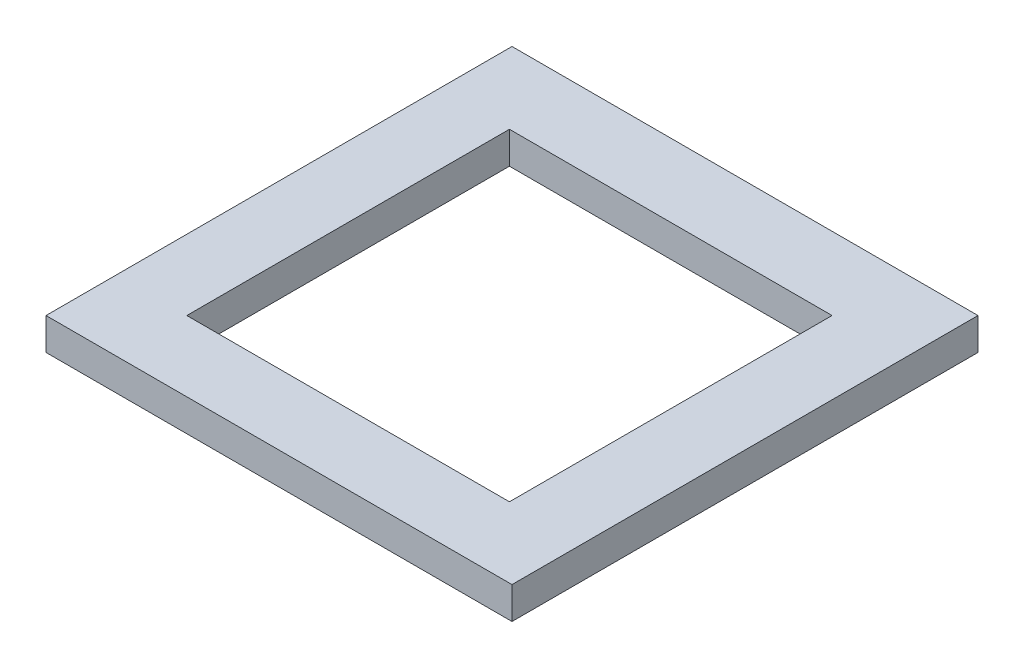
ISO-10303-21;
HEADER;
FILE_DESCRIPTION(('STEP AP214'),'2;1');
FILE_NAME('part.step','',(''),(''),'','','');
FILE_SCHEMA(('AUTOMOTIVE_DESIGN { 1 0 10303 214 1 1 1 1 }'));
ENDSEC;
DATA;
#1=APPLICATION_CONTEXT('core data for automotive mechanical design processes');
#2=APPLICATION_PROTOCOL_DEFINITION('international standard','automotive_design',2000,#1);
#3=PRODUCT_CONTEXT('',#1,'mechanical');
#4=PRODUCT('Part','Part','',(#3));
#5=PRODUCT_RELATED_PRODUCT_CATEGORY('part','',(#4));
#6=PRODUCT_DEFINITION_FORMATION('','',#4);
#7=PRODUCT_DEFINITION_CONTEXT('part definition',#1,'design');
#8=PRODUCT_DEFINITION('design','',#6,#7);
#9=PRODUCT_DEFINITION_SHAPE('','',#8);
#10=(LENGTH_UNIT() NAMED_UNIT(*) SI_UNIT(.MILLI.,.METRE.));
#11=(NAMED_UNIT(*) PLANE_ANGLE_UNIT() SI_UNIT($,.RADIAN.));
#12=(NAMED_UNIT(*) SI_UNIT($,.STERADIAN.) SOLID_ANGLE_UNIT());
#13=UNCERTAINTY_MEASURE_WITH_UNIT(LENGTH_MEASURE(1.E-05),#10,'distance_accuracy_value','');
#14=(GEOMETRIC_REPRESENTATION_CONTEXT(3) GLOBAL_UNCERTAINTY_ASSIGNED_CONTEXT((#13)) GLOBAL_UNIT_ASSIGNED_CONTEXT((#10,
#11,#12)) REPRESENTATION_CONTEXT('',''));
#15=CARTESIAN_POINT('',(0.,0.,0.));
#16=DIRECTION('',(0.,0.,1.));
#17=DIRECTION('',(1.,0.,0.));
#18=AXIS2_PLACEMENT_3D('',#15,#16,#17);
#19=CARTESIAN_POINT('',(0.,3.175,0.));
#20=DIRECTION('',(0.,-1.,0.));
#21=DIRECTION('',(0.,0.,-1.));
#22=AXIS2_PLACEMENT_3D('',#19,#20,#21);
#23=PLANE('',#22);
#24=DIRECTION('',(0.,0.,-1.));
#25=VECTOR('',#24,1.);
#26=CARTESIAN_POINT('',(296.475530674392,3.175,-285.287805934991));
#27=LINE('',#26,#25);
#28=CARTESIAN_POINT('',(296.475530674392,3.175,-285.287805934991));
#29=VERTEX_POINT('',#28);
#30=CARTESIAN_POINT('',(296.475530674392,3.175,-331.515805934991));
#31=VERTEX_POINT('',#30);
#32=EDGE_CURVE('E134',#29,#31,#27,.T.);
#33=ORIENTED_EDGE('',*,*,#32,.T.);
#34=DIRECTION('',(-1.,0.,0.));
#35=VECTOR('',#34,1.);
#36=CARTESIAN_POINT('',(250.247530674392,3.175,-331.515805934991));
#37=LINE('',#36,#35);
#38=CARTESIAN_POINT('',(250.247530674392,3.175,-331.515805934991));
#39=VERTEX_POINT('',#38);
#40=EDGE_CURVE('E137',#31,#39,#37,.T.);
#41=ORIENTED_EDGE('',*,*,#40,.T.);
#42=DIRECTION('',(0.,0.,1.));
#43=VECTOR('',#42,1.);
#44=CARTESIAN_POINT('',(250.247530674392,3.175,-285.287805934991));
#45=LINE('',#44,#43);
#46=CARTESIAN_POINT('',(250.247530674392,3.175,-285.287805934991));
#47=VERTEX_POINT('',#46);
#48=EDGE_CURVE('E140',#39,#47,#45,.T.);
#49=ORIENTED_EDGE('',*,*,#48,.T.);
#50=DIRECTION('',(1.,0.,0.));
#51=VECTOR('',#50,1.);
#52=CARTESIAN_POINT('',(250.247530674392,3.175,-285.287805934991));
#53=LINE('',#52,#51);
#54=EDGE_CURVE('E142',#47,#29,#53,.T.);
#55=ORIENTED_EDGE('',*,*,#54,.T.);
#56=EDGE_LOOP('',(#33,#41,#49,#55));
#57=FACE_BOUND('',#56,.T.);
#58=DIRECTION('',(0.,0.,-1.));
#59=VECTOR('',#58,1.);
#60=CARTESIAN_POINT('',(289.236530674392,3.175,-292.272805934991));
#61=LINE('',#60,#59);
#62=CARTESIAN_POINT('',(289.236530674392,3.175,-292.272805934991));
#63=VERTEX_POINT('',#62);
#64=CARTESIAN_POINT('',(289.236530674392,3.175,-324.276805934991));
#65=VERTEX_POINT('',#64);
#66=EDGE_CURVE('E98',#63,#65,#61,.T.);
#67=ORIENTED_EDGE('',*,*,#66,.F.);
#68=DIRECTION('',(1.,0.,0.));
#69=VECTOR('',#68,1.);
#70=CARTESIAN_POINT('',(257.232530674392,3.175,-292.272805934991));
#71=LINE('',#70,#69);
#72=CARTESIAN_POINT('',(257.232530674392,3.175,-292.272805934991));
#73=VERTEX_POINT('',#72);
#74=EDGE_CURVE('E120',#73,#63,#71,.T.);
#75=ORIENTED_EDGE('',*,*,#74,.F.);
#76=DIRECTION('',(0.,0.,1.));
#77=VECTOR('',#76,1.);
#78=CARTESIAN_POINT('',(257.232530674392,3.175,-292.272805934991));
#79=LINE('',#78,#77);
#80=CARTESIAN_POINT('',(257.232530674392,3.175,-324.276805934991));
#81=VERTEX_POINT('',#80);
#82=EDGE_CURVE('E118',#81,#73,#79,.T.);
#83=ORIENTED_EDGE('',*,*,#82,.F.);
#84=DIRECTION('',(-1.,0.,0.));
#85=VECTOR('',#84,1.);
#86=CARTESIAN_POINT('',(257.232530674392,3.175,-324.276805934991));
#87=LINE('',#86,#85);
#88=EDGE_CURVE('E106',#65,#81,#87,.T.);
#89=ORIENTED_EDGE('',*,*,#88,.F.);
#90=EDGE_LOOP('',(#67,#75,#83,#89));
#91=FACE_BOUND('',#90,.T.);
#92=ADVANCED_FACE('F33',(#57,#91),#23,.F.);
#93=CARTESIAN_POINT('',(0.,0.,0.));
#94=DIRECTION('',(0.,-1.,0.));
#95=DIRECTION('',(0.,0.,-1.));
#96=AXIS2_PLACEMENT_3D('',#93,#94,#95);
#97=PLANE('',#96);
#98=DIRECTION('',(0.,0.,-1.));
#99=VECTOR('',#98,1.);
#100=CARTESIAN_POINT('',(296.475530674392,0.,-285.287805934991));
#101=LINE('',#100,#99);
#102=CARTESIAN_POINT('',(296.475530674392,0.,-285.287805934991));
#103=VERTEX_POINT('',#102);
#104=CARTESIAN_POINT('',(296.475530674392,0.,-331.515805934991));
#105=VERTEX_POINT('',#104);
#106=EDGE_CURVE('E114',#103,#105,#101,.T.);
#107=ORIENTED_EDGE('',*,*,#106,.F.);
#108=DIRECTION('',(1.,0.,0.));
#109=VECTOR('',#108,1.);
#110=CARTESIAN_POINT('',(250.247530674392,0.,-285.287805934991));
#111=LINE('',#110,#109);
#112=CARTESIAN_POINT('',(250.247530674392,0.,-285.287805934991));
#113=VERTEX_POINT('',#112);
#114=EDGE_CURVE('E138',#113,#103,#111,.T.);
#115=ORIENTED_EDGE('',*,*,#114,.F.);
#116=DIRECTION('',(0.,0.,1.));
#117=VECTOR('',#116,1.);
#118=CARTESIAN_POINT('',(250.247530674392,0.,-285.287805934991));
#119=LINE('',#118,#117);
#120=CARTESIAN_POINT('',(250.247530674392,0.,-331.515805934991));
#121=VERTEX_POINT('',#120);
#122=EDGE_CURVE('E149',#121,#113,#119,.T.);
#123=ORIENTED_EDGE('',*,*,#122,.F.);
#124=DIRECTION('',(-1.,0.,0.));
#125=VECTOR('',#124,1.);
#126=CARTESIAN_POINT('',(250.247530674392,0.,-331.515805934991));
#127=LINE('',#126,#125);
#128=EDGE_CURVE('E147',#105,#121,#127,.T.);
#129=ORIENTED_EDGE('',*,*,#128,.F.);
#130=EDGE_LOOP('',(#107,#115,#123,#129));
#131=FACE_BOUND('',#130,.T.);
#132=DIRECTION('',(1.,0.,0.));
#133=VECTOR('',#132,1.);
#134=CARTESIAN_POINT('',(257.232530674392,0.,-292.272805934991));
#135=LINE('',#134,#133);
#136=CARTESIAN_POINT('',(257.232530674392,0.,-292.272805934991));
#137=VERTEX_POINT('',#136);
#138=CARTESIAN_POINT('',(289.236530674392,0.,-292.272805934991));
#139=VERTEX_POINT('',#138);
#140=EDGE_CURVE('E107',#137,#139,#135,.T.);
#141=ORIENTED_EDGE('',*,*,#140,.T.);
#142=DIRECTION('',(0.,0.,-1.));
#143=VECTOR('',#142,1.);
#144=CARTESIAN_POINT('',(289.236530674392,0.,-292.272805934991));
#145=LINE('',#144,#143);
#146=CARTESIAN_POINT('',(289.236530674392,0.,-324.276805934991));
#147=VERTEX_POINT('',#146);
#148=EDGE_CURVE('E56',#139,#147,#145,.T.);
#149=ORIENTED_EDGE('',*,*,#148,.T.);
#150=DIRECTION('',(-1.,0.,0.));
#151=VECTOR('',#150,1.);
#152=CARTESIAN_POINT('',(257.232530674392,0.,-324.276805934991));
#153=LINE('',#152,#151);
#154=CARTESIAN_POINT('',(257.232530674392,0.,-324.276805934991));
#155=VERTEX_POINT('',#154);
#156=EDGE_CURVE('E113',#147,#155,#153,.T.);
#157=ORIENTED_EDGE('',*,*,#156,.T.);
#158=DIRECTION('',(0.,0.,1.));
#159=VECTOR('',#158,1.);
#160=CARTESIAN_POINT('',(257.232530674392,0.,-292.272805934991));
#161=LINE('',#160,#159);
#162=EDGE_CURVE('E126',#155,#137,#161,.T.);
#163=ORIENTED_EDGE('',*,*,#162,.T.);
#164=EDGE_LOOP('',(#141,#149,#157,#163));
#165=FACE_BOUND('',#164,.T.);
#166=ADVANCED_FACE('F167',(#131,#165),#97,.T.);
#167=CARTESIAN_POINT('',(296.475530674392,3.175,-285.287805934991));
#168=DIRECTION('',(-1.,0.,0.));
#169=DIRECTION('',(0.,0.,1.));
#170=AXIS2_PLACEMENT_3D('',#167,#168,#169);
#171=PLANE('',#170);
#172=ORIENTED_EDGE('',*,*,#106,.T.);
#173=DIRECTION('',(0.,-1.,0.));
#174=VECTOR('',#173,1.);
#175=CARTESIAN_POINT('',(296.475530674392,3.175,-331.515805934991));
#176=LINE('',#175,#174);
#177=EDGE_CURVE('E11',#31,#105,#176,.T.);
#178=ORIENTED_EDGE('',*,*,#177,.F.);
#179=ORIENTED_EDGE('',*,*,#32,.F.);
#180=DIRECTION('',(0.,-1.,0.));
#181=VECTOR('',#180,1.);
#182=CARTESIAN_POINT('',(296.475530674392,3.175,-285.287805934991));
#183=LINE('',#182,#181);
#184=EDGE_CURVE('E144',#29,#103,#183,.T.);
#185=ORIENTED_EDGE('',*,*,#184,.T.);
#186=EDGE_LOOP('',(#172,#178,#179,#185));
#187=FACE_BOUND('',#186,.T.);
#188=ADVANCED_FACE('F35',(#187),#171,.F.);
#189=CARTESIAN_POINT('',(250.247530674392,3.175,-331.515805934991));
#190=DIRECTION('',(0.,0.,1.));
#191=DIRECTION('',(1.,0.,0.));
#192=AXIS2_PLACEMENT_3D('',#189,#190,#191);
#193=PLANE('',#192);
#194=ORIENTED_EDGE('',*,*,#128,.T.);
#195=DIRECTION('',(0.,-1.,0.));
#196=VECTOR('',#195,1.);
#197=CARTESIAN_POINT('',(250.247530674392,3.175,-331.515805934991));
#198=LINE('',#197,#196);
#199=EDGE_CURVE('E41',#39,#121,#198,.T.);
#200=ORIENTED_EDGE('',*,*,#199,.F.);
#201=ORIENTED_EDGE('',*,*,#40,.F.);
#202=ORIENTED_EDGE('',*,*,#177,.T.);
#203=EDGE_LOOP('',(#194,#200,#201,#202));
#204=FACE_BOUND('',#203,.T.);
#205=ADVANCED_FACE('F177',(#204),#193,.F.);
#206=CARTESIAN_POINT('',(250.247530674392,3.175,-285.287805934991));
#207=DIRECTION('',(1.,0.,0.));
#208=DIRECTION('',(0.,0.,-1.));
#209=AXIS2_PLACEMENT_3D('',#206,#207,#208);
#210=PLANE('',#209);
#211=ORIENTED_EDGE('',*,*,#122,.T.);
#212=DIRECTION('',(0.,-1.,0.));
#213=VECTOR('',#212,1.);
#214=CARTESIAN_POINT('',(250.247530674392,3.175,-285.287805934991));
#215=LINE('',#214,#213);
#216=EDGE_CURVE('E154',#47,#113,#215,.T.);
#217=ORIENTED_EDGE('',*,*,#216,.F.);
#218=ORIENTED_EDGE('',*,*,#48,.F.);
#219=ORIENTED_EDGE('',*,*,#199,.T.);
#220=EDGE_LOOP('',(#211,#217,#218,#219));
#221=FACE_BOUND('',#220,.T.);
#222=ADVANCED_FACE('F161',(#221),#210,.F.);
#223=CARTESIAN_POINT('',(250.247530674392,3.175,-285.287805934991));
#224=DIRECTION('',(0.,0.,-1.));
#225=DIRECTION('',(-1.,0.,0.));
#226=AXIS2_PLACEMENT_3D('',#223,#224,#225);
#227=PLANE('',#226);
#228=ORIENTED_EDGE('',*,*,#114,.T.);
#229=ORIENTED_EDGE('',*,*,#184,.F.);
#230=ORIENTED_EDGE('',*,*,#54,.F.);
#231=ORIENTED_EDGE('',*,*,#216,.T.);
#232=EDGE_LOOP('',(#228,#229,#230,#231));
#233=FACE_BOUND('',#232,.T.);
#234=ADVANCED_FACE('F171',(#233),#227,.F.);
#235=CARTESIAN_POINT('',(289.236530674392,3.175,-292.272805934991));
#236=DIRECTION('',(-1.,0.,0.));
#237=DIRECTION('',(0.,0.,1.));
#238=AXIS2_PLACEMENT_3D('',#235,#236,#237);
#239=PLANE('',#238);
#240=ORIENTED_EDGE('',*,*,#148,.F.);
#241=DIRECTION('',(0.,-1.,0.));
#242=VECTOR('',#241,1.);
#243=CARTESIAN_POINT('',(289.236530674392,3.175,-292.272805934991));
#244=LINE('',#243,#242);
#245=EDGE_CURVE('E102',#63,#139,#244,.T.);
#246=ORIENTED_EDGE('',*,*,#245,.F.);
#247=ORIENTED_EDGE('',*,*,#66,.T.);
#248=DIRECTION('',(0.,-1.,0.));
#249=VECTOR('',#248,1.);
#250=CARTESIAN_POINT('',(289.236530674392,3.175,-324.276805934991));
#251=LINE('',#250,#249);
#252=EDGE_CURVE('E101',#65,#147,#251,.T.);
#253=ORIENTED_EDGE('',*,*,#252,.T.);
#254=EDGE_LOOP('',(#240,#246,#247,#253));
#255=FACE_BOUND('',#254,.T.);
#256=ADVANCED_FACE('F100',(#255),#239,.T.);
#257=CARTESIAN_POINT('',(257.232530674392,3.175,-324.276805934991));
#258=DIRECTION('',(0.,0.,1.));
#259=DIRECTION('',(1.,0.,0.));
#260=AXIS2_PLACEMENT_3D('',#257,#258,#259);
#261=PLANE('',#260);
#262=ORIENTED_EDGE('',*,*,#156,.F.);
#263=ORIENTED_EDGE('',*,*,#252,.F.);
#264=ORIENTED_EDGE('',*,*,#88,.T.);
#265=DIRECTION('',(0.,-1.,0.));
#266=VECTOR('',#265,1.);
#267=CARTESIAN_POINT('',(257.232530674392,3.175,-324.276805934991));
#268=LINE('',#267,#266);
#269=EDGE_CURVE('E115',#81,#155,#268,.T.);
#270=ORIENTED_EDGE('',*,*,#269,.T.);
#271=EDGE_LOOP('',(#262,#263,#264,#270));
#272=FACE_BOUND('',#271,.T.);
#273=ADVANCED_FACE('F110',(#272),#261,.T.);
#274=CARTESIAN_POINT('',(257.232530674392,3.175,-292.272805934991));
#275=DIRECTION('',(1.,0.,0.));
#276=DIRECTION('',(0.,0.,-1.));
#277=AXIS2_PLACEMENT_3D('',#274,#275,#276);
#278=PLANE('',#277);
#279=ORIENTED_EDGE('',*,*,#162,.F.);
#280=ORIENTED_EDGE('',*,*,#269,.F.);
#281=ORIENTED_EDGE('',*,*,#82,.T.);
#282=DIRECTION('',(0.,-1.,0.));
#283=VECTOR('',#282,1.);
#284=CARTESIAN_POINT('',(257.232530674392,3.175,-292.272805934991));
#285=LINE('',#284,#283);
#286=EDGE_CURVE('E48',#73,#137,#285,.T.);
#287=ORIENTED_EDGE('',*,*,#286,.T.);
#288=EDGE_LOOP('',(#279,#280,#281,#287));
#289=FACE_BOUND('',#288,.T.);
#290=ADVANCED_FACE('F200',(#289),#278,.T.);
#291=CARTESIAN_POINT('',(257.232530674392,3.175,-292.272805934991));
#292=DIRECTION('',(0.,0.,-1.));
#293=DIRECTION('',(-1.,0.,0.));
#294=AXIS2_PLACEMENT_3D('',#291,#292,#293);
#295=PLANE('',#294);
#296=ORIENTED_EDGE('',*,*,#140,.F.);
#297=ORIENTED_EDGE('',*,*,#286,.F.);
#298=ORIENTED_EDGE('',*,*,#74,.T.);
#299=ORIENTED_EDGE('',*,*,#245,.T.);
#300=EDGE_LOOP('',(#296,#297,#298,#299));
#301=FACE_BOUND('',#300,.T.);
#302=ADVANCED_FACE('F204',(#301),#295,.T.);
#303=CLOSED_SHELL('',(#92,#166,#188,#205,#222,#234,#256,#273,#290,#302));
#304=MANIFOLD_SOLID_BREP('B2',#303);
#305=ADVANCED_BREP_SHAPE_REPRESENTATION('',(#18,#304),#14);
#306=SHAPE_DEFINITION_REPRESENTATION(#9,#305);
ENDSEC;
END-ISO-10303-21;
